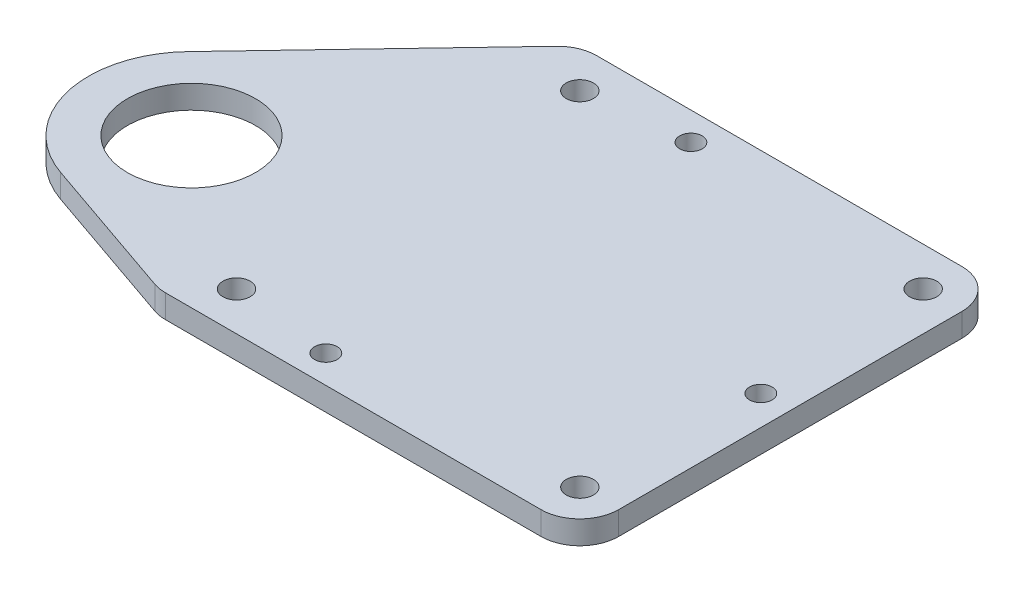
ISO-10303-21;
HEADER;
FILE_DESCRIPTION(('STEP AP214'),'2;1');
FILE_NAME('part.step','',(''),(''),'','','');
FILE_SCHEMA(('AUTOMOTIVE_DESIGN { 1 0 10303 214 1 1 1 1 }'));
ENDSEC;
DATA;
#1=APPLICATION_CONTEXT('core data for automotive mechanical design processes');
#2=APPLICATION_PROTOCOL_DEFINITION('international standard','automotive_design',2000,#1);
#3=PRODUCT_CONTEXT('',#1,'mechanical');
#4=PRODUCT('Part','Part','',(#3));
#5=PRODUCT_RELATED_PRODUCT_CATEGORY('part','',(#4));
#6=PRODUCT_DEFINITION_FORMATION('','',#4);
#7=PRODUCT_DEFINITION_CONTEXT('part definition',#1,'design');
#8=PRODUCT_DEFINITION('design','',#6,#7);
#9=PRODUCT_DEFINITION_SHAPE('','',#8);
#10=(LENGTH_UNIT() NAMED_UNIT(*) SI_UNIT(.MILLI.,.METRE.));
#11=(NAMED_UNIT(*) PLANE_ANGLE_UNIT() SI_UNIT($,.RADIAN.));
#12=(NAMED_UNIT(*) SI_UNIT($,.STERADIAN.) SOLID_ANGLE_UNIT());
#13=UNCERTAINTY_MEASURE_WITH_UNIT(LENGTH_MEASURE(1.E-05),#10,'distance_accuracy_value','');
#14=(GEOMETRIC_REPRESENTATION_CONTEXT(3) GLOBAL_UNCERTAINTY_ASSIGNED_CONTEXT((#13)) GLOBAL_UNIT_ASSIGNED_CONTEXT((#10,
#11,#12)) REPRESENTATION_CONTEXT('',''));
#15=CARTESIAN_POINT('',(0.,0.,0.));
#16=DIRECTION('',(0.,0.,1.));
#17=DIRECTION('',(1.,0.,0.));
#18=AXIS2_PLACEMENT_3D('',#15,#16,#17);
#19=CARTESIAN_POINT('',(0.,3.,0.));
#20=DIRECTION('',(0.,0.,-1.));
#21=DIRECTION('',(-1.,0.,0.));
#22=AXIS2_PLACEMENT_3D('',#19,#20,#21);
#23=PLANE('',#22);
#24=DIRECTION('',(1.,0.,0.));
#25=VECTOR('',#24,1.);
#26=CARTESIAN_POINT('',(0.,3.,0.));
#27=LINE('',#26,#25);
#28=CARTESIAN_POINT('',(0.839282517237476,3.,0.));
#29=VERTEX_POINT('',#28);
#30=CARTESIAN_POINT('',(49.2,3.,0.));
#31=VERTEX_POINT('',#30);
#32=EDGE_CURVE('E275',#29,#31,#27,.T.);
#33=ORIENTED_EDGE('',*,*,#32,.F.);
#34=DIRECTION('',(0.,-1.,0.));
#35=VECTOR('',#34,1.);
#36=CARTESIAN_POINT('',(0.839282517237476,0.,0.));
#37=LINE('',#36,#35);
#38=CARTESIAN_POINT('',(0.839282517237476,0.,0.));
#39=VERTEX_POINT('',#38);
#40=EDGE_CURVE('E213',#29,#39,#37,.T.);
#41=ORIENTED_EDGE('',*,*,#40,.T.);
#42=DIRECTION('',(1.,0.,0.));
#43=VECTOR('',#42,1.);
#44=CARTESIAN_POINT('',(0.,0.,0.));
#45=LINE('',#44,#43);
#46=CARTESIAN_POINT('',(49.2,0.,0.));
#47=VERTEX_POINT('',#46);
#48=EDGE_CURVE('E184',#39,#47,#45,.T.);
#49=ORIENTED_EDGE('',*,*,#48,.T.);
#50=DIRECTION('',(0.,-1.,0.));
#51=VECTOR('',#50,1.);
#52=CARTESIAN_POINT('',(49.2,3.,0.));
#53=LINE('',#52,#51);
#54=EDGE_CURVE('E140',#47,#31,#53,.F.);
#55=ORIENTED_EDGE('',*,*,#54,.T.);
#56=EDGE_LOOP('',(#33,#41,#49,#55));
#57=FACE_BOUND('',#56,.T.);
#58=ADVANCED_FACE('F41',(#57),#23,.F.);
#59=CARTESIAN_POINT('',(54.2,3.,0.));
#60=DIRECTION('',(-1.,0.,0.));
#61=DIRECTION('',(0.,0.,1.));
#62=AXIS2_PLACEMENT_3D('',#59,#60,#61);
#63=PLANE('',#62);
#64=DIRECTION('',(0.,0.,-1.));
#65=VECTOR('',#64,1.);
#66=CARTESIAN_POINT('',(54.2,0.,0.));
#67=LINE('',#66,#65);
#68=CARTESIAN_POINT('',(54.2,0.,-5.));
#69=VERTEX_POINT('',#68);
#70=CARTESIAN_POINT('',(54.2,0.,-49.2));
#71=VERTEX_POINT('',#70);
#72=EDGE_CURVE('E188',#69,#71,#67,.T.);
#73=ORIENTED_EDGE('',*,*,#72,.T.);
#74=DIRECTION('',(0.,-1.,0.));
#75=VECTOR('',#74,1.);
#76=CARTESIAN_POINT('',(54.2,3.,-49.2));
#77=LINE('',#76,#75);
#78=CARTESIAN_POINT('',(54.2,3.,-49.2));
#79=VERTEX_POINT('',#78);
#80=EDGE_CURVE('E11',#71,#79,#77,.F.);
#81=ORIENTED_EDGE('',*,*,#80,.T.);
#82=DIRECTION('',(0.,0.,-1.));
#83=VECTOR('',#82,1.);
#84=CARTESIAN_POINT('',(54.2,3.,0.));
#85=LINE('',#84,#83);
#86=CARTESIAN_POINT('',(54.2,3.,-5.));
#87=VERTEX_POINT('',#86);
#88=EDGE_CURVE('E259',#87,#79,#85,.T.);
#89=ORIENTED_EDGE('',*,*,#88,.F.);
#90=DIRECTION('',(0.,-1.,0.));
#91=VECTOR('',#90,1.);
#92=CARTESIAN_POINT('',(54.2,3.,-5.));
#93=LINE('',#92,#91);
#94=EDGE_CURVE('E50',#87,#69,#93,.T.);
#95=ORIENTED_EDGE('',*,*,#94,.T.);
#96=EDGE_LOOP('',(#73,#81,#89,#95));
#97=FACE_BOUND('',#96,.T.);
#98=ADVANCED_FACE('F257',(#97),#63,.F.);
#99=CARTESIAN_POINT('',(0.,3.,-54.2));
#100=DIRECTION('',(0.,0.,-1.));
#101=DIRECTION('',(-1.,0.,0.));
#102=AXIS2_PLACEMENT_3D('',#99,#100,#101);
#103=PLANE('',#102);
#104=DIRECTION('',(1.,0.,0.));
#105=VECTOR('',#104,1.);
#106=CARTESIAN_POINT('',(0.,0.,-54.2));
#107=LINE('',#106,#105);
#108=CARTESIAN_POINT('',(2.14500152314093,0.,-54.2));
#109=VERTEX_POINT('',#108);
#110=CARTESIAN_POINT('',(49.2,0.,-54.2));
#111=VERTEX_POINT('',#110);
#112=EDGE_CURVE('E192',#109,#111,#107,.T.);
#113=ORIENTED_EDGE('',*,*,#112,.F.);
#114=DIRECTION('',(0.,-1.,0.));
#115=VECTOR('',#114,1.);
#116=CARTESIAN_POINT('',(2.14500152314093,3.,-54.2));
#117=LINE('',#116,#115);
#118=CARTESIAN_POINT('',(2.14500152314093,3.,-54.2));
#119=VERTEX_POINT('',#118);
#120=EDGE_CURVE('E249',#109,#119,#117,.F.);
#121=ORIENTED_EDGE('',*,*,#120,.T.);
#122=DIRECTION('',(1.,0.,0.));
#123=VECTOR('',#122,1.);
#124=CARTESIAN_POINT('',(0.,3.,-54.2));
#125=LINE('',#124,#123);
#126=CARTESIAN_POINT('',(49.2,3.,-54.2));
#127=VERTEX_POINT('',#126);
#128=EDGE_CURVE('E129',#119,#127,#125,.T.);
#129=ORIENTED_EDGE('',*,*,#128,.T.);
#130=DIRECTION('',(0.,-1.,0.));
#131=VECTOR('',#130,1.);
#132=CARTESIAN_POINT('',(49.2,0.,-54.2));
#133=LINE('',#132,#131);
#134=EDGE_CURVE('E245',#127,#111,#133,.T.);
#135=ORIENTED_EDGE('',*,*,#134,.T.);
#136=EDGE_LOOP('',(#113,#121,#129,#135));
#137=FACE_BOUND('',#136,.T.);
#138=ADVANCED_FACE('F271',(#137),#103,.T.);
#139=CARTESIAN_POINT('',(-27.065833563896,3.,-25.7396127420908));
#140=DIRECTION('',(0.724637423752309,0.,0.689130324465275));
#141=DIRECTION('',(0.689130324465276,0.,-0.72463742375231));
#142=AXIS2_PLACEMENT_3D('',#139,#140,#141);
#143=PLANE('',#142);
#144=DIRECTION('',(-0.689130324465276,0.,0.72463742375231));
#145=VECTOR('',#144,1.);
#146=CARTESIAN_POINT('',(-27.065833563896,3.,-25.7396127420908));
#147=LINE('',#146,#145);
#148=CARTESIAN_POINT('',(-1.47818559562061,3.,-52.6456516223264));
#149=VERTEX_POINT('',#148);
#150=CARTESIAN_POINT('',(-24.6014458647181,3.,-28.3309767991649));
#151=VERTEX_POINT('',#150);
#152=EDGE_CURVE('E117',#149,#151,#147,.T.);
#153=ORIENTED_EDGE('',*,*,#152,.F.);
#154=DIRECTION('',(0.,-1.,0.));
#155=VECTOR('',#154,1.);
#156=CARTESIAN_POINT('',(-1.47818559562062,0.,-52.6456516223264));
#157=LINE('',#156,#155);
#158=CARTESIAN_POINT('',(-1.47818559562061,0.,-52.6456516223264));
#159=VERTEX_POINT('',#158);
#160=EDGE_CURVE('E242',#149,#159,#157,.T.);
#161=ORIENTED_EDGE('',*,*,#160,.T.);
#162=DIRECTION('',(-0.689130324465276,0.,0.72463742375231));
#163=VECTOR('',#162,1.);
#164=CARTESIAN_POINT('',(-27.065833563896,0.,-25.7396127420908));
#165=LINE('',#164,#163);
#166=CARTESIAN_POINT('',(-24.6014458647181,0.,-28.3309767991649));
#167=VERTEX_POINT('',#166);
#168=EDGE_CURVE('E135',#159,#167,#165,.T.);
#169=ORIENTED_EDGE('',*,*,#168,.T.);
#170=DIRECTION('',(0.,-1.,0.));
#171=VECTOR('',#170,1.);
#172=CARTESIAN_POINT('',(-24.6014458647181,3.,-28.3309767991649));
#173=LINE('',#172,#171);
#174=EDGE_CURVE('E132',#151,#167,#173,.T.);
#175=ORIENTED_EDGE('',*,*,#174,.F.);
#176=EDGE_LOOP('',(#153,#161,#169,#175));
#177=FACE_BOUND('',#176,.T.);
#178=ADVANCED_FACE('F133',(#177),#143,.F.);
#179=CARTESIAN_POINT('',(-15.,3.,-19.2));
#180=DIRECTION('',(0.,-1.,0.));
#181=DIRECTION('',(0.,0.,-1.));
#182=AXIS2_PLACEMENT_3D('',#179,#180,#181);
#183=CYLINDRICAL_SURFACE('',#182,13.25);
#184=CARTESIAN_POINT('',(-15.,0.,-19.2));
#185=DIRECTION('',(0.,1.,0.));
#186=DIRECTION('',(0.,0.,1.));
#187=AXIS2_PLACEMENT_3D('',#184,#185,#186);
#188=CIRCLE('',#187,13.25);
#189=CARTESIAN_POINT('',(-19.3263003432721,0.,-6.67619764848535));
#190=VERTEX_POINT('',#189);
#191=EDGE_CURVE('E198',#167,#190,#188,.T.);
#192=ORIENTED_EDGE('',*,*,#191,.T.);
#193=DIRECTION('',(0.,-1.,0.));
#194=VECTOR('',#193,1.);
#195=CARTESIAN_POINT('',(-19.3263003432721,3.,-6.67619764848535));
#196=LINE('',#195,#194);
#197=CARTESIAN_POINT('',(-19.3263003432721,3.,-6.67619764848535));
#198=VERTEX_POINT('',#197);
#199=EDGE_CURVE('E141',#198,#190,#196,.T.);
#200=ORIENTED_EDGE('',*,*,#199,.F.);
#201=CARTESIAN_POINT('',(-15.,3.,-19.2));
#202=DIRECTION('',(0.,1.,0.));
#203=DIRECTION('',(0.,0.,1.));
#204=AXIS2_PLACEMENT_3D('',#201,#202,#203);
#205=CIRCLE('',#204,13.25);
#206=EDGE_CURVE('E123',#151,#198,#205,.T.);
#207=ORIENTED_EDGE('',*,*,#206,.F.);
#208=ORIENTED_EDGE('',*,*,#174,.T.);
#209=EDGE_LOOP('',(#192,#200,#207,#208));
#210=FACE_BOUND('',#209,.T.);
#211=ADVANCED_FACE('F143',(#210),#183,.T.);
#212=CARTESIAN_POINT('',(0.,3.,0.));
#213=DIRECTION('',(-0.326513233454497,0.,0.945192630302992));
#214=DIRECTION('',(0.945192630302992,0.,0.326513233454497));
#215=AXIS2_PLACEMENT_3D('',#212,#213,#214);
#216=PLANE('',#215);
#217=DIRECTION('',(-0.945192630302992,0.,-0.326513233454497));
#218=VECTOR('',#217,1.);
#219=CARTESIAN_POINT('',(0.,0.,0.));
#220=LINE('',#219,#218);
#221=CARTESIAN_POINT('',(-0.793283650035008,0.,-0.274036848485039));
#222=VERTEX_POINT('',#221);
#223=EDGE_CURVE('E201',#222,#190,#220,.T.);
#224=ORIENTED_EDGE('',*,*,#223,.F.);
#225=DIRECTION('',(0.,-1.,0.));
#226=VECTOR('',#225,1.);
#227=CARTESIAN_POINT('',(-0.793283650035008,3.,-0.274036848485039));
#228=LINE('',#227,#226);
#229=CARTESIAN_POINT('',(-0.793283650035008,3.,-0.274036848485039));
#230=VERTEX_POINT('',#229);
#231=EDGE_CURVE('E229',#222,#230,#228,.F.);
#232=ORIENTED_EDGE('',*,*,#231,.T.);
#233=DIRECTION('',(-0.945192630302992,0.,-0.326513233454497));
#234=VECTOR('',#233,1.);
#235=CARTESIAN_POINT('',(0.,3.,0.));
#236=LINE('',#235,#234);
#237=EDGE_CURVE('E146',#230,#198,#236,.T.);
#238=ORIENTED_EDGE('',*,*,#237,.T.);
#239=ORIENTED_EDGE('',*,*,#199,.T.);
#240=EDGE_LOOP('',(#224,#232,#238,#239));
#241=FACE_BOUND('',#240,.T.);
#242=ADVANCED_FACE('F332',(#241),#216,.T.);
#243=CARTESIAN_POINT('',(17.9,3.,-50.6));
#244=DIRECTION('',(0.,-1.,0.));
#245=DIRECTION('',(0.,0.,-1.));
#246=AXIS2_PLACEMENT_3D('',#243,#244,#245);
#247=CYLINDRICAL_SURFACE('',#246,1.45);
#248=CARTESIAN_POINT('',(17.9,3.,-50.6));
#249=DIRECTION('',(0.,1.,0.));
#250=DIRECTION('',(0.,0.,1.));
#251=AXIS2_PLACEMENT_3D('',#248,#249,#250);
#252=CIRCLE('',#251,1.45);
#253=CARTESIAN_POINT('',(17.9,3.,-49.15));
#254=VERTEX_POINT('',#253);
#255=EDGE_CURVE('E281',#254,#254,#252,.T.);
#256=ORIENTED_EDGE('',*,*,#255,.T.);
#257=EDGE_LOOP('',(#256));
#258=FACE_BOUND('',#257,.T.);
#259=CARTESIAN_POINT('',(17.9,0.,-50.6));
#260=DIRECTION('',(0.,1.,0.));
#261=DIRECTION('',(0.,0.,1.));
#262=AXIS2_PLACEMENT_3D('',#259,#260,#261);
#263=CIRCLE('',#262,1.45);
#264=CARTESIAN_POINT('',(17.9,0.,-49.15));
#265=VERTEX_POINT('',#264);
#266=EDGE_CURVE('E180',#265,#265,#263,.T.);
#267=ORIENTED_EDGE('',*,*,#266,.F.);
#268=EDGE_LOOP('',(#267));
#269=FACE_BOUND('',#268,.T.);
#270=ADVANCED_FACE('F328',(#258,#269),#247,.F.);
#271=CARTESIAN_POINT('',(17.9,3.,-3.6));
#272=DIRECTION('',(0.,-1.,0.));
#273=DIRECTION('',(0.,0.,-1.));
#274=AXIS2_PLACEMENT_3D('',#271,#272,#273);
#275=CYLINDRICAL_SURFACE('',#274,1.45);
#276=CARTESIAN_POINT('',(17.9,3.,-3.6));
#277=DIRECTION('',(0.,1.,0.));
#278=DIRECTION('',(0.,0.,1.));
#279=AXIS2_PLACEMENT_3D('',#276,#277,#278);
#280=CIRCLE('',#279,1.45);
#281=CARTESIAN_POINT('',(17.9,3.,-2.15));
#282=VERTEX_POINT('',#281);
#283=EDGE_CURVE('E285',#282,#282,#280,.T.);
#284=ORIENTED_EDGE('',*,*,#283,.T.);
#285=EDGE_LOOP('',(#284));
#286=FACE_BOUND('',#285,.T.);
#287=CARTESIAN_POINT('',(17.9,0.,-3.6));
#288=DIRECTION('',(0.,1.,0.));
#289=DIRECTION('',(0.,0.,1.));
#290=AXIS2_PLACEMENT_3D('',#287,#288,#289);
#291=CIRCLE('',#290,1.45);
#292=CARTESIAN_POINT('',(17.9,0.,-2.15));
#293=VERTEX_POINT('',#292);
#294=EDGE_CURVE('E176',#293,#293,#291,.T.);
#295=ORIENTED_EDGE('',*,*,#294,.F.);
#296=EDGE_LOOP('',(#295));
#297=FACE_BOUND('',#296,.T.);
#298=ADVANCED_FACE('F331',(#286,#297),#275,.F.);
#299=CARTESIAN_POINT('',(50.4,3.,-27.1));
#300=DIRECTION('',(0.,-1.,0.));
#301=DIRECTION('',(0.,0.,-1.));
#302=AXIS2_PLACEMENT_3D('',#299,#300,#301);
#303=CYLINDRICAL_SURFACE('',#302,1.45);
#304=CARTESIAN_POINT('',(50.4,3.,-27.1));
#305=DIRECTION('',(0.,1.,0.));
#306=DIRECTION('',(0.,0.,1.));
#307=AXIS2_PLACEMENT_3D('',#304,#305,#306);
#308=CIRCLE('',#307,1.45);
#309=CARTESIAN_POINT('',(50.4,3.,-25.65));
#310=VERTEX_POINT('',#309);
#311=EDGE_CURVE('E289',#310,#310,#308,.T.);
#312=ORIENTED_EDGE('',*,*,#311,.T.);
#313=EDGE_LOOP('',(#312));
#314=FACE_BOUND('',#313,.T.);
#315=CARTESIAN_POINT('',(50.4,0.,-27.1));
#316=DIRECTION('',(0.,1.,0.));
#317=DIRECTION('',(0.,0.,1.));
#318=AXIS2_PLACEMENT_3D('',#315,#316,#317);
#319=CIRCLE('',#318,1.45);
#320=CARTESIAN_POINT('',(50.4,0.,-25.65));
#321=VERTEX_POINT('',#320);
#322=EDGE_CURVE('E172',#321,#321,#319,.T.);
#323=ORIENTED_EDGE('',*,*,#322,.F.);
#324=EDGE_LOOP('',(#323));
#325=FACE_BOUND('',#324,.T.);
#326=ADVANCED_FACE('F360',(#314,#325),#303,.F.);
#327=CARTESIAN_POINT('',(5.,3.,-49.2));
#328=DIRECTION('',(0.,-1.,0.));
#329=DIRECTION('',(0.,0.,-1.));
#330=AXIS2_PLACEMENT_3D('',#327,#328,#329);
#331=CYLINDRICAL_SURFACE('',#330,1.75);
#332=CARTESIAN_POINT('',(5.,3.,-49.2));
#333=DIRECTION('',(0.,1.,0.));
#334=DIRECTION('',(0.,0.,1.));
#335=AXIS2_PLACEMENT_3D('',#332,#333,#334);
#336=CIRCLE('',#335,1.75);
#337=CARTESIAN_POINT('',(5.,3.,-47.45));
#338=VERTEX_POINT('',#337);
#339=EDGE_CURVE('E293',#338,#338,#336,.T.);
#340=ORIENTED_EDGE('',*,*,#339,.T.);
#341=EDGE_LOOP('',(#340));
#342=FACE_BOUND('',#341,.T.);
#343=CARTESIAN_POINT('',(5.,0.,-49.2));
#344=DIRECTION('',(0.,1.,0.));
#345=DIRECTION('',(0.,0.,1.));
#346=AXIS2_PLACEMENT_3D('',#343,#344,#345);
#347=CIRCLE('',#346,1.75);
#348=CARTESIAN_POINT('',(5.,0.,-47.45));
#349=VERTEX_POINT('',#348);
#350=EDGE_CURVE('E168',#349,#349,#347,.T.);
#351=ORIENTED_EDGE('',*,*,#350,.F.);
#352=EDGE_LOOP('',(#351));
#353=FACE_BOUND('',#352,.T.);
#354=ADVANCED_FACE('F364',(#342,#353),#331,.F.);
#355=CARTESIAN_POINT('',(49.2,3.,-49.2));
#356=DIRECTION('',(0.,-1.,0.));
#357=DIRECTION('',(0.,0.,-1.));
#358=AXIS2_PLACEMENT_3D('',#355,#356,#357);
#359=CYLINDRICAL_SURFACE('',#358,1.75);
#360=CARTESIAN_POINT('',(49.2,3.,-49.2));
#361=DIRECTION('',(0.,1.,0.));
#362=DIRECTION('',(0.,0.,1.));
#363=AXIS2_PLACEMENT_3D('',#360,#361,#362);
#364=CIRCLE('',#363,1.75);
#365=CARTESIAN_POINT('',(49.2,3.,-47.45));
#366=VERTEX_POINT('',#365);
#367=EDGE_CURVE('E297',#366,#366,#364,.T.);
#368=ORIENTED_EDGE('',*,*,#367,.T.);
#369=EDGE_LOOP('',(#368));
#370=FACE_BOUND('',#369,.T.);
#371=CARTESIAN_POINT('',(49.2,0.,-49.2));
#372=DIRECTION('',(0.,1.,0.));
#373=DIRECTION('',(0.,0.,1.));
#374=AXIS2_PLACEMENT_3D('',#371,#372,#373);
#375=CIRCLE('',#374,1.75);
#376=CARTESIAN_POINT('',(49.2,0.,-47.45));
#377=VERTEX_POINT('',#376);
#378=EDGE_CURVE('E164',#377,#377,#375,.T.);
#379=ORIENTED_EDGE('',*,*,#378,.F.);
#380=EDGE_LOOP('',(#379));
#381=FACE_BOUND('',#380,.T.);
#382=ADVANCED_FACE('F368',(#370,#381),#359,.F.);
#383=CARTESIAN_POINT('',(49.2,3.,-4.99999999999999));
#384=DIRECTION('',(0.,-1.,0.));
#385=DIRECTION('',(0.,0.,-1.));
#386=AXIS2_PLACEMENT_3D('',#383,#384,#385);
#387=CYLINDRICAL_SURFACE('',#386,1.75);
#388=CARTESIAN_POINT('',(49.2,3.,-4.99999999999999));
#389=DIRECTION('',(0.,1.,0.));
#390=DIRECTION('',(0.,0.,1.));
#391=AXIS2_PLACEMENT_3D('',#388,#389,#390);
#392=CIRCLE('',#391,1.75);
#393=CARTESIAN_POINT('',(49.2,3.,-3.24999999999999));
#394=VERTEX_POINT('',#393);
#395=EDGE_CURVE('E301',#394,#394,#392,.T.);
#396=ORIENTED_EDGE('',*,*,#395,.T.);
#397=EDGE_LOOP('',(#396));
#398=FACE_BOUND('',#397,.T.);
#399=CARTESIAN_POINT('',(49.2,0.,-4.99999999999999));
#400=DIRECTION('',(0.,1.,0.));
#401=DIRECTION('',(0.,0.,1.));
#402=AXIS2_PLACEMENT_3D('',#399,#400,#401);
#403=CIRCLE('',#402,1.75);
#404=CARTESIAN_POINT('',(49.2,0.,-3.24999999999999));
#405=VERTEX_POINT('',#404);
#406=EDGE_CURVE('E160',#405,#405,#403,.T.);
#407=ORIENTED_EDGE('',*,*,#406,.F.);
#408=EDGE_LOOP('',(#407));
#409=FACE_BOUND('',#408,.T.);
#410=ADVANCED_FACE('F372',(#398,#409),#387,.F.);
#411=CARTESIAN_POINT('',(5.,3.,-4.99999999999999));
#412=DIRECTION('',(0.,-1.,0.));
#413=DIRECTION('',(0.,0.,-1.));
#414=AXIS2_PLACEMENT_3D('',#411,#412,#413);
#415=CYLINDRICAL_SURFACE('',#414,1.75);
#416=CARTESIAN_POINT('',(5.,3.,-4.99999999999999));
#417=DIRECTION('',(0.,1.,0.));
#418=DIRECTION('',(0.,0.,1.));
#419=AXIS2_PLACEMENT_3D('',#416,#417,#418);
#420=CIRCLE('',#419,1.75);
#421=CARTESIAN_POINT('',(5.,3.,-3.24999999999999));
#422=VERTEX_POINT('',#421);
#423=EDGE_CURVE('E208',#422,#422,#420,.T.);
#424=ORIENTED_EDGE('',*,*,#423,.T.);
#425=EDGE_LOOP('',(#424));
#426=FACE_BOUND('',#425,.T.);
#427=CARTESIAN_POINT('',(5.,0.,-4.99999999999999));
#428=DIRECTION('',(0.,1.,0.));
#429=DIRECTION('',(0.,0.,1.));
#430=AXIS2_PLACEMENT_3D('',#427,#428,#429);
#431=CIRCLE('',#430,1.75);
#432=CARTESIAN_POINT('',(5.,0.,-3.24999999999999));
#433=VERTEX_POINT('',#432);
#434=EDGE_CURVE('E156',#433,#433,#431,.T.);
#435=ORIENTED_EDGE('',*,*,#434,.F.);
#436=EDGE_LOOP('',(#435));
#437=FACE_BOUND('',#436,.T.);
#438=ADVANCED_FACE('F309',(#426,#437),#415,.F.);
#439=CARTESIAN_POINT('',(-15.,3.,-19.2));
#440=DIRECTION('',(0.,-1.,0.));
#441=DIRECTION('',(0.,0.,-1.));
#442=AXIS2_PLACEMENT_3D('',#439,#440,#441);
#443=CYLINDRICAL_SURFACE('',#442,8.25);
#444=CARTESIAN_POINT('',(-15.,3.,-19.2));
#445=DIRECTION('',(0.,1.,0.));
#446=DIRECTION('',(0.,0.,1.));
#447=AXIS2_PLACEMENT_3D('',#444,#445,#446);
#448=CIRCLE('',#447,8.25);
#449=CARTESIAN_POINT('',(-15.,3.,-10.95));
#450=VERTEX_POINT('',#449);
#451=EDGE_CURVE('E149',#450,#450,#448,.T.);
#452=ORIENTED_EDGE('',*,*,#451,.T.);
#453=EDGE_LOOP('',(#452));
#454=FACE_BOUND('',#453,.T.);
#455=CARTESIAN_POINT('',(-15.,0.,-19.2));
#456=DIRECTION('',(0.,1.,0.));
#457=DIRECTION('',(0.,0.,1.));
#458=AXIS2_PLACEMENT_3D('',#455,#456,#457);
#459=CIRCLE('',#458,8.25);
#460=CARTESIAN_POINT('',(-15.,0.,-10.95));
#461=VERTEX_POINT('',#460);
#462=EDGE_CURVE('E204',#461,#461,#459,.T.);
#463=ORIENTED_EDGE('',*,*,#462,.F.);
#464=EDGE_LOOP('',(#463));
#465=FACE_BOUND('',#464,.T.);
#466=ADVANCED_FACE('F314',(#454,#465),#443,.F.);
#467=CARTESIAN_POINT('',(0.,3.,0.));
#468=DIRECTION('',(0.,1.,0.));
#469=DIRECTION('',(0.,0.,1.));
#470=AXIS2_PLACEMENT_3D('',#467,#468,#469);
#471=PLANE('',#470);
#472=ORIENTED_EDGE('',*,*,#423,.F.);
#473=EDGE_LOOP('',(#472));
#474=FACE_BOUND('',#473,.T.);
#475=ORIENTED_EDGE('',*,*,#395,.F.);
#476=EDGE_LOOP('',(#475));
#477=FACE_BOUND('',#476,.T.);
#478=ORIENTED_EDGE('',*,*,#367,.F.);
#479=EDGE_LOOP('',(#478));
#480=FACE_BOUND('',#479,.T.);
#481=ORIENTED_EDGE('',*,*,#339,.F.);
#482=EDGE_LOOP('',(#481));
#483=FACE_BOUND('',#482,.T.);
#484=ORIENTED_EDGE('',*,*,#311,.F.);
#485=EDGE_LOOP('',(#484));
#486=FACE_BOUND('',#485,.T.);
#487=ORIENTED_EDGE('',*,*,#283,.F.);
#488=EDGE_LOOP('',(#487));
#489=FACE_BOUND('',#488,.T.);
#490=ORIENTED_EDGE('',*,*,#255,.F.);
#491=EDGE_LOOP('',(#490));
#492=FACE_BOUND('',#491,.T.);
#493=ORIENTED_EDGE('',*,*,#237,.F.);
#494=CARTESIAN_POINT('',(0.839282517237476,3.,-5.));
#495=DIRECTION('',(0.,1.,0.));
#496=DIRECTION('',(0.,0.,1.));
#497=AXIS2_PLACEMENT_3D('',#494,#495,#496);
#498=CIRCLE('',#497,5.);
#499=EDGE_CURVE('E239',#230,#29,#498,.T.);
#500=ORIENTED_EDGE('',*,*,#499,.T.);
#501=ORIENTED_EDGE('',*,*,#32,.T.);
#502=CARTESIAN_POINT('',(49.2,3.,-5.));
#503=DIRECTION('',(0.,1.,0.));
#504=DIRECTION('',(0.,0.,1.));
#505=AXIS2_PLACEMENT_3D('',#502,#503,#504);
#506=CIRCLE('',#505,5.);
#507=EDGE_CURVE('E232',#31,#87,#506,.T.);
#508=ORIENTED_EDGE('',*,*,#507,.T.);
#509=ORIENTED_EDGE('',*,*,#88,.T.);
#510=CARTESIAN_POINT('',(49.2,3.,-49.2));
#511=DIRECTION('',(0.,1.,0.));
#512=DIRECTION('',(0.,0.,1.));
#513=AXIS2_PLACEMENT_3D('',#510,#511,#512);
#514=CIRCLE('',#513,5.);
#515=EDGE_CURVE('E63',#79,#127,#514,.T.);
#516=ORIENTED_EDGE('',*,*,#515,.T.);
#517=ORIENTED_EDGE('',*,*,#128,.F.);
#518=CARTESIAN_POINT('',(2.14500152314093,3.,-49.2));
#519=DIRECTION('',(0.,1.,0.));
#520=DIRECTION('',(0.,0.,1.));
#521=AXIS2_PLACEMENT_3D('',#518,#519,#520);
#522=CIRCLE('',#521,5.);
#523=EDGE_CURVE('E57',#119,#149,#522,.T.);
#524=ORIENTED_EDGE('',*,*,#523,.T.);
#525=ORIENTED_EDGE('',*,*,#152,.T.);
#526=ORIENTED_EDGE('',*,*,#206,.T.);
#527=EDGE_LOOP('',(#493,#500,#501,#508,#509,#516,#517,#524,#525,#526));
#528=FACE_BOUND('',#527,.T.);
#529=ORIENTED_EDGE('',*,*,#451,.F.);
#530=EDGE_LOOP('',(#529));
#531=FACE_BOUND('',#530,.T.);
#532=ADVANCED_FACE('F120',(#474,#477,#480,#483,#486,#489,#492,#528,#531),#471,.T.);
#533=CARTESIAN_POINT('',(0.,0.,0.));
#534=DIRECTION('',(0.,1.,0.));
#535=DIRECTION('',(0.,0.,1.));
#536=AXIS2_PLACEMENT_3D('',#533,#534,#535);
#537=PLANE('',#536);
#538=ORIENTED_EDGE('',*,*,#434,.T.);
#539=EDGE_LOOP('',(#538));
#540=FACE_BOUND('',#539,.T.);
#541=ORIENTED_EDGE('',*,*,#406,.T.);
#542=EDGE_LOOP('',(#541));
#543=FACE_BOUND('',#542,.T.);
#544=ORIENTED_EDGE('',*,*,#378,.T.);
#545=EDGE_LOOP('',(#544));
#546=FACE_BOUND('',#545,.T.);
#547=ORIENTED_EDGE('',*,*,#350,.T.);
#548=EDGE_LOOP('',(#547));
#549=FACE_BOUND('',#548,.T.);
#550=ORIENTED_EDGE('',*,*,#322,.T.);
#551=EDGE_LOOP('',(#550));
#552=FACE_BOUND('',#551,.T.);
#553=ORIENTED_EDGE('',*,*,#294,.T.);
#554=EDGE_LOOP('',(#553));
#555=FACE_BOUND('',#554,.T.);
#556=ORIENTED_EDGE('',*,*,#266,.T.);
#557=EDGE_LOOP('',(#556));
#558=FACE_BOUND('',#557,.T.);
#559=ORIENTED_EDGE('',*,*,#48,.F.);
#560=CARTESIAN_POINT('',(0.839282517237476,0.,-5.));
#561=DIRECTION('',(0.,1.,0.));
#562=DIRECTION('',(0.,0.,1.));
#563=AXIS2_PLACEMENT_3D('',#560,#561,#562);
#564=CIRCLE('',#563,5.);
#565=EDGE_CURVE('E226',#39,#222,#564,.F.);
#566=ORIENTED_EDGE('',*,*,#565,.T.);
#567=ORIENTED_EDGE('',*,*,#223,.T.);
#568=ORIENTED_EDGE('',*,*,#191,.F.);
#569=ORIENTED_EDGE('',*,*,#168,.F.);
#570=CARTESIAN_POINT('',(2.14500152314093,0.,-49.2));
#571=DIRECTION('',(0.,1.,0.));
#572=DIRECTION('',(0.,0.,1.));
#573=AXIS2_PLACEMENT_3D('',#570,#571,#572);
#574=CIRCLE('',#573,5.);
#575=EDGE_CURVE('E223',#159,#109,#574,.F.);
#576=ORIENTED_EDGE('',*,*,#575,.T.);
#577=ORIENTED_EDGE('',*,*,#112,.T.);
#578=CARTESIAN_POINT('',(49.2,0.,-49.2));
#579=DIRECTION('',(0.,1.,0.));
#580=DIRECTION('',(0.,0.,1.));
#581=AXIS2_PLACEMENT_3D('',#578,#579,#580);
#582=CIRCLE('',#581,5.);
#583=EDGE_CURVE('E220',#111,#71,#582,.F.);
#584=ORIENTED_EDGE('',*,*,#583,.T.);
#585=ORIENTED_EDGE('',*,*,#72,.F.);
#586=CARTESIAN_POINT('',(49.2,0.,-5.));
#587=DIRECTION('',(0.,1.,0.));
#588=DIRECTION('',(0.,0.,1.));
#589=AXIS2_PLACEMENT_3D('',#586,#587,#588);
#590=CIRCLE('',#589,5.);
#591=EDGE_CURVE('E217',#69,#47,#590,.F.);
#592=ORIENTED_EDGE('',*,*,#591,.T.);
#593=EDGE_LOOP('',(#559,#566,#567,#568,#569,#576,#577,#584,#585,#592));
#594=FACE_BOUND('',#593,.T.);
#595=ORIENTED_EDGE('',*,*,#462,.T.);
#596=EDGE_LOOP('',(#595));
#597=FACE_BOUND('',#596,.T.);
#598=ADVANCED_FACE('F264',(#540,#543,#546,#549,#552,#555,#558,#594,#597),#537,.F.);
#599=CARTESIAN_POINT('',(0.839282517237476,3.,-5.));
#600=DIRECTION('',(0.,1.,0.));
#601=DIRECTION('',(0.,0.,1.));
#602=AXIS2_PLACEMENT_3D('',#599,#600,#601);
#603=CYLINDRICAL_SURFACE('',#602,5.);
#604=ORIENTED_EDGE('',*,*,#499,.F.);
#605=ORIENTED_EDGE('',*,*,#231,.F.);
#606=ORIENTED_EDGE('',*,*,#565,.F.);
#607=ORIENTED_EDGE('',*,*,#40,.F.);
#608=EDGE_LOOP('',(#604,#605,#606,#607));
#609=FACE_BOUND('',#608,.T.);
#610=ADVANCED_FACE('F337',(#609),#603,.T.);
#611=CARTESIAN_POINT('',(2.14500152314093,3.,-49.2));
#612=DIRECTION('',(0.,1.,0.));
#613=DIRECTION('',(0.,0.,1.));
#614=AXIS2_PLACEMENT_3D('',#611,#612,#613);
#615=CYLINDRICAL_SURFACE('',#614,5.);
#616=ORIENTED_EDGE('',*,*,#523,.F.);
#617=ORIENTED_EDGE('',*,*,#120,.F.);
#618=ORIENTED_EDGE('',*,*,#575,.F.);
#619=ORIENTED_EDGE('',*,*,#160,.F.);
#620=EDGE_LOOP('',(#616,#617,#618,#619));
#621=FACE_BOUND('',#620,.T.);
#622=ADVANCED_FACE('F343',(#621),#615,.T.);
#623=CARTESIAN_POINT('',(49.2,3.,-49.2));
#624=DIRECTION('',(0.,1.,0.));
#625=DIRECTION('',(0.,0.,1.));
#626=AXIS2_PLACEMENT_3D('',#623,#624,#625);
#627=CYLINDRICAL_SURFACE('',#626,5.);
#628=ORIENTED_EDGE('',*,*,#515,.F.);
#629=ORIENTED_EDGE('',*,*,#80,.F.);
#630=ORIENTED_EDGE('',*,*,#583,.F.);
#631=ORIENTED_EDGE('',*,*,#134,.F.);
#632=EDGE_LOOP('',(#628,#629,#630,#631));
#633=FACE_BOUND('',#632,.T.);
#634=ADVANCED_FACE('F269',(#633),#627,.T.);
#635=CARTESIAN_POINT('',(49.2,3.,-5.));
#636=DIRECTION('',(0.,-1.,0.));
#637=DIRECTION('',(0.,0.,-1.));
#638=AXIS2_PLACEMENT_3D('',#635,#636,#637);
#639=CYLINDRICAL_SURFACE('',#638,5.);
#640=ORIENTED_EDGE('',*,*,#507,.F.);
#641=ORIENTED_EDGE('',*,*,#54,.F.);
#642=ORIENTED_EDGE('',*,*,#591,.F.);
#643=ORIENTED_EDGE('',*,*,#94,.F.);
#644=EDGE_LOOP('',(#640,#641,#642,#643));
#645=FACE_BOUND('',#644,.T.);
#646=ADVANCED_FACE('F43',(#645),#639,.T.);
#647=CLOSED_SHELL('',(#58,#98,#138,#178,#211,#242,#270,#298,#326,#354,#382,#410,#438,#466,#532,
#598,#610,#622,#634,#646));
#648=MANIFOLD_SOLID_BREP('B2',#647);
#649=ADVANCED_BREP_SHAPE_REPRESENTATION('',(#18,#648),#14);
#650=SHAPE_DEFINITION_REPRESENTATION(#9,#649);
ENDSEC;
END-ISO-10303-21;
